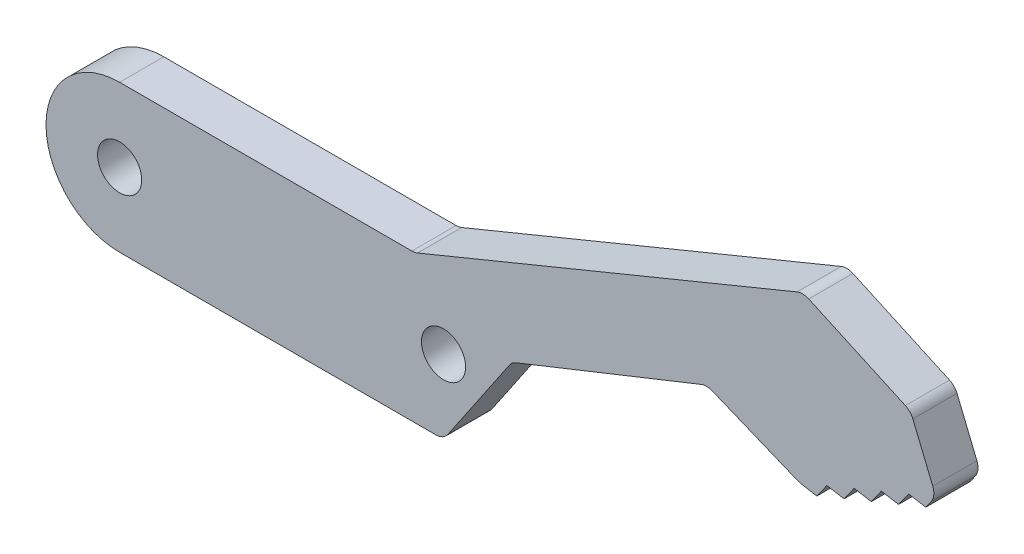
ISO-10303-21;
HEADER;
FILE_DESCRIPTION(('STEP AP214'),'2;1');
FILE_NAME('part.step','',(''),(''),'','','');
FILE_SCHEMA(('AUTOMOTIVE_DESIGN { 1 0 10303 214 1 1 1 1 }'));
ENDSEC;
DATA;
#1=APPLICATION_CONTEXT('core data for automotive mechanical design processes');
#2=APPLICATION_PROTOCOL_DEFINITION('international standard','automotive_design',2000,#1);
#3=PRODUCT_CONTEXT('',#1,'mechanical');
#4=PRODUCT('Part','Part','',(#3));
#5=PRODUCT_RELATED_PRODUCT_CATEGORY('part','',(#4));
#6=PRODUCT_DEFINITION_FORMATION('','',#4);
#7=PRODUCT_DEFINITION_CONTEXT('part definition',#1,'design');
#8=PRODUCT_DEFINITION('design','',#6,#7);
#9=PRODUCT_DEFINITION_SHAPE('','',#8);
#10=(LENGTH_UNIT() NAMED_UNIT(*) SI_UNIT(.MILLI.,.METRE.));
#11=(NAMED_UNIT(*) PLANE_ANGLE_UNIT() SI_UNIT($,.RADIAN.));
#12=(NAMED_UNIT(*) SI_UNIT($,.STERADIAN.) SOLID_ANGLE_UNIT());
#13=UNCERTAINTY_MEASURE_WITH_UNIT(LENGTH_MEASURE(1.E-05),#10,'distance_accuracy_value','');
#14=(GEOMETRIC_REPRESENTATION_CONTEXT(3) GLOBAL_UNCERTAINTY_ASSIGNED_CONTEXT((#13)) GLOBAL_UNIT_ASSIGNED_CONTEXT((#10,
#11,#12)) REPRESENTATION_CONTEXT('',''));
#15=CARTESIAN_POINT('',(0.,0.,0.));
#16=DIRECTION('',(0.,0.,1.));
#17=DIRECTION('',(1.,0.,0.));
#18=AXIS2_PLACEMENT_3D('',#15,#16,#17);
#19=CARTESIAN_POINT('',(17.3962094769043,-11.7918515015879,3.));
#20=DIRECTION('',(0.82775687017251,-0.561086948593719,0.));
#21=DIRECTION('',(0.561086948593719,0.82775687017251,0.));
#22=AXIS2_PLACEMENT_3D('',#19,#20,#21);
#23=PLANE('',#22);
#24=DIRECTION('',(-0.561086948593719,-0.82775687017251,0.));
#25=VECTOR('',#24,1.);
#26=CARTESIAN_POINT('',(17.3962094769043,-11.7918515015879,0.));
#27=LINE('',#26,#25);
#28=CARTESIAN_POINT('',(26.4721926347983,1.59770858592846,0.));
#29=VERTEX_POINT('',#28);
#30=CARTESIAN_POINT('',(22.2975129456313,-4.56108694859372,0.));
#31=VERTEX_POINT('',#30);
#32=EDGE_CURVE('E351',#29,#31,#27,.T.);
#33=ORIENTED_EDGE('',*,*,#32,.F.);
#34=DIRECTION('',(0.,0.,-1.));
#35=VECTOR('',#34,1.);
#36=CARTESIAN_POINT('',(26.4721926347983,1.59770858592845,3.));
#37=LINE('',#36,#35);
#38=CARTESIAN_POINT('',(26.4721926347983,1.59770858592846,3.));
#39=VERTEX_POINT('',#38);
#40=EDGE_CURVE('E254',#29,#39,#37,.F.);
#41=ORIENTED_EDGE('',*,*,#40,.T.);
#42=DIRECTION('',(-0.561086948593719,-0.82775687017251,0.));
#43=VECTOR('',#42,1.);
#44=CARTESIAN_POINT('',(17.3962094769043,-11.7918515015879,3.));
#45=LINE('',#44,#43);
#46=CARTESIAN_POINT('',(22.2975129456313,-4.56108694859372,3.));
#47=VERTEX_POINT('',#46);
#48=EDGE_CURVE('E768',#39,#47,#45,.T.);
#49=ORIENTED_EDGE('',*,*,#48,.T.);
#50=DIRECTION('',(0.,0.,-1.));
#51=VECTOR('',#50,1.);
#52=CARTESIAN_POINT('',(22.2975129456313,-4.56108694859372,0.));
#53=LINE('',#52,#51);
#54=EDGE_CURVE('E251',#47,#31,#53,.T.);
#55=ORIENTED_EDGE('',*,*,#54,.T.);
#56=EDGE_LOOP('',(#33,#41,#49,#55));
#57=FACE_BOUND('',#56,.T.);
#58=ADVANCED_FACE('F34',(#57),#23,.T.);
#59=CARTESIAN_POINT('',(3.01771045687276,-7.56855690668185,3.));
#60=DIRECTION('',(0.370362872235569,-0.928887152925166,0.));
#61=DIRECTION('',(0.928887152925166,0.370362872235569,0.));
#62=AXIS2_PLACEMENT_3D('',#59,#60,#61);
#63=PLANE('',#62);
#64=DIRECTION('',(-0.928887152925166,-0.370362872235569,0.));
#65=VECTOR('',#64,1.);
#66=CARTESIAN_POINT('',(3.01771045687276,-7.56855690668185,3.));
#67=LINE('',#66,#65);
#68=CARTESIAN_POINT('',(39.4964940516571,6.97614534835353,3.));
#69=VERTEX_POINT('',#68);
#70=CARTESIAN_POINT('',(26.9295866327353,1.9655087902599,3.));
#71=VERTEX_POINT('',#70);
#72=EDGE_CURVE('E775',#69,#71,#67,.T.);
#73=ORIENTED_EDGE('',*,*,#72,.T.);
#74=DIRECTION('',(0.,0.,-1.));
#75=VECTOR('',#74,1.);
#76=CARTESIAN_POINT('',(26.9295866327353,1.9655087902599,0.));
#77=LINE('',#76,#75);
#78=CARTESIAN_POINT('',(26.9295866327353,1.9655087902599,0.));
#79=VERTEX_POINT('',#78);
#80=EDGE_CURVE('E243',#71,#79,#77,.T.);
#81=ORIENTED_EDGE('',*,*,#80,.T.);
#82=DIRECTION('',(-0.928887152925166,-0.370362872235569,0.));
#83=VECTOR('',#82,1.);
#84=CARTESIAN_POINT('',(3.01771045687276,-7.56855690668185,0.));
#85=LINE('',#84,#83);
#86=CARTESIAN_POINT('',(39.4964940516571,6.97614534835353,0.));
#87=VERTEX_POINT('',#86);
#88=EDGE_CURVE('E353',#87,#79,#85,.T.);
#89=ORIENTED_EDGE('',*,*,#88,.F.);
#90=DIRECTION('',(0.,0.,-1.));
#91=VECTOR('',#90,1.);
#92=CARTESIAN_POINT('',(39.4964940516571,6.97614534835353,3.));
#93=LINE('',#92,#91);
#94=EDGE_CURVE('E241',#87,#69,#93,.F.);
#95=ORIENTED_EDGE('',*,*,#94,.T.);
#96=EDGE_LOOP('',(#73,#81,#89,#95));
#97=FACE_BOUND('',#96,.T.);
#98=ADVANCED_FACE('F496',(#97),#63,.T.);
#99=CARTESIAN_POINT('',(8.22079154562797,20.0822867610106,3.));
#100=DIRECTION('',(-0.378842481424512,-0.925461168428,0.));
#101=DIRECTION('',(0.925461168428,-0.378842481424512,0.));
#102=AXIS2_PLACEMENT_3D('',#99,#100,#101);
#103=PLANE('',#102);
#104=DIRECTION('',(-0.925461168428,0.378842481424512,0.));
#105=VECTOR('',#104,1.);
#106=CARTESIAN_POINT('',(8.22079154562797,20.0822867610106,3.));
#107=LINE('',#106,#105);
#108=CARTESIAN_POINT('',(46.0879419933528,4.58116609869354,3.));
#109=VERTEX_POINT('',#108);
#110=CARTESIAN_POINT('',(40.2456994053172,6.97271936385637,3.));
#111=VERTEX_POINT('',#110);
#112=EDGE_CURVE('E226',#109,#111,#107,.T.);
#113=ORIENTED_EDGE('',*,*,#112,.T.);
#114=DIRECTION('',(0.,0.,-1.));
#115=VECTOR('',#114,1.);
#116=CARTESIAN_POINT('',(40.2456994053171,6.97271936385637,0.));
#117=LINE('',#116,#115);
#118=CARTESIAN_POINT('',(40.2456994053172,6.97271936385637,0.));
#119=VERTEX_POINT('',#118);
#120=EDGE_CURVE('E278',#111,#119,#117,.T.);
#121=ORIENTED_EDGE('',*,*,#120,.T.);
#122=DIRECTION('',(-0.925461168428,0.378842481424512,0.));
#123=VECTOR('',#122,1.);
#124=CARTESIAN_POINT('',(8.22079154562797,20.0822867610106,0.));
#125=LINE('',#124,#123);
#126=CARTESIAN_POINT('',(46.0879419933528,4.58116609869354,0.));
#127=VERTEX_POINT('',#126);
#128=EDGE_CURVE('E356',#127,#119,#125,.T.);
#129=ORIENTED_EDGE('',*,*,#128,.F.);
#130=DIRECTION('',(0.,0.,-1.));
#131=VECTOR('',#130,1.);
#132=CARTESIAN_POINT('',(46.0879419933528,4.58116609869354,3.));
#133=LINE('',#132,#131);
#134=EDGE_CURVE('E276',#127,#109,#133,.F.);
#135=ORIENTED_EDGE('',*,*,#134,.T.);
#136=EDGE_LOOP('',(#113,#121,#129,#135));
#137=FACE_BOUND('',#136,.T.);
#138=ADVANCED_FACE('F502',(#137),#103,.T.);
#139=CARTESIAN_POINT('',(2.12068725055261,12.2001062019428,3.));
#140=DIRECTION('',(0.171257275030367,0.985226342395073,0.));
#141=DIRECTION('',(-0.985226342395073,0.171257275030367,0.));
#142=AXIS2_PLACEMENT_3D('',#139,#140,#141);
#143=PLANE('',#142);
#144=DIRECTION('',(0.985226342395073,-0.171257275030367,0.));
#145=VECTOR('',#144,1.);
#146=CARTESIAN_POINT('',(2.12068725055261,12.2001062019428,3.));
#147=LINE('',#146,#145);
#148=CARTESIAN_POINT('',(46.2955271997469,4.52140092472648,3.));
#149=VERTEX_POINT('',#148);
#150=CARTESIAN_POINT('',(47.3529322035688,4.33759717145107,3.));
#151=VERTEX_POINT('',#150);
#152=EDGE_CURVE('E212',#149,#151,#147,.T.);
#153=ORIENTED_EDGE('',*,*,#152,.F.);
#154=DIRECTION('',(0.,0.,-1.));
#155=VECTOR('',#154,1.);
#156=CARTESIAN_POINT('',(46.2955271997469,4.52140092472648,0.));
#157=LINE('',#156,#155);
#158=CARTESIAN_POINT('',(46.2955271997469,4.52140092472648,0.));
#159=VERTEX_POINT('',#158);
#160=EDGE_CURVE('E281',#149,#159,#157,.T.);
#161=ORIENTED_EDGE('',*,*,#160,.T.);
#162=DIRECTION('',(0.985226342395073,-0.171257275030367,0.));
#163=VECTOR('',#162,1.);
#164=CARTESIAN_POINT('',(2.12068725055261,12.2001062019428,0.));
#165=LINE('',#164,#163);
#166=CARTESIAN_POINT('',(47.3529322035688,4.33759717145107,0.));
#167=VERTEX_POINT('',#166);
#168=EDGE_CURVE('E239',#159,#167,#165,.T.);
#169=ORIENTED_EDGE('',*,*,#168,.T.);
#170=DIRECTION('',(0.,0.,-1.));
#171=VECTOR('',#170,1.);
#172=CARTESIAN_POINT('',(47.3529322035688,4.33759717145107,3.));
#173=LINE('',#172,#171);
#174=EDGE_CURVE('E232',#151,#167,#173,.T.);
#175=ORIENTED_EDGE('',*,*,#174,.F.);
#176=EDGE_LOOP('',(#153,#161,#169,#175));
#177=FACE_BOUND('',#176,.T.);
#178=ADVANCED_FACE('F237',(#177),#143,.F.);
#179=CARTESIAN_POINT('',(29.3832302084347,-20.911746854221,3.));
#180=DIRECTION('',(-0.814732571298571,0.579836905746106,0.));
#181=DIRECTION('',(-0.579836905746107,-0.814732571298571,0.));
#182=AXIS2_PLACEMENT_3D('',#179,#180,#181);
#183=PLANE('',#182);
#184=DIRECTION('',(0.579836905746107,0.814732571298571,0.));
#185=VECTOR('',#184,1.);
#186=CARTESIAN_POINT('',(29.3832302084347,-20.911746854221,0.));
#187=LINE('',#186,#185);
#188=CARTESIAN_POINT('',(48.0382444817135,5.30053386792921,0.));
#189=VERTEX_POINT('',#188);
#190=EDGE_CURVE('E360',#167,#189,#187,.T.);
#191=ORIENTED_EDGE('',*,*,#190,.T.);
#192=DIRECTION('',(0.,0.,-1.));
#193=VECTOR('',#192,1.);
#194=CARTESIAN_POINT('',(48.0382444817135,5.30053386792921,3.));
#195=LINE('',#194,#193);
#196=CARTESIAN_POINT('',(48.0382444817135,5.30053386792921,3.));
#197=VERTEX_POINT('',#196);
#198=EDGE_CURVE('E234',#197,#189,#195,.T.);
#199=ORIENTED_EDGE('',*,*,#198,.F.);
#200=DIRECTION('',(0.579836905746107,0.814732571298571,0.));
#201=VECTOR('',#200,1.);
#202=CARTESIAN_POINT('',(29.3832302084347,-20.911746854221,3.));
#203=LINE('',#202,#201);
#204=EDGE_CURVE('E217',#151,#197,#203,.T.);
#205=ORIENTED_EDGE('',*,*,#204,.F.);
#206=ORIENTED_EDGE('',*,*,#174,.T.);
#207=EDGE_LOOP('',(#191,#199,#205,#206));
#208=FACE_BOUND('',#207,.T.);
#209=ADVANCED_FACE('F231',(#208),#183,.F.);
#210=CARTESIAN_POINT('',(2.30326040358772,13.2504316830205,3.));
#211=DIRECTION('',(0.171257275030366,0.985226342395073,0.));
#212=DIRECTION('',(-0.985226342395073,0.171257275030366,0.));
#213=AXIS2_PLACEMENT_3D('',#210,#211,#212);
#214=PLANE('',#213);
#215=DIRECTION('',(0.985226342395073,-0.171257275030366,0.));
#216=VECTOR('',#215,1.);
#217=CARTESIAN_POINT('',(2.30326040358772,13.2504316830205,0.));
#218=LINE('',#217,#216);
#219=CARTESIAN_POINT('',(49.2026886599019,5.09812399691749,0.));
#220=VERTEX_POINT('',#219);
#221=EDGE_CURVE('E362',#189,#220,#218,.T.);
#222=ORIENTED_EDGE('',*,*,#221,.T.);
#223=DIRECTION('',(0.,0.,-1.));
#224=VECTOR('',#223,1.);
#225=CARTESIAN_POINT('',(49.2026886599019,5.09812399691749,3.));
#226=LINE('',#225,#224);
#227=CARTESIAN_POINT('',(49.2026886599019,5.09812399691749,3.));
#228=VERTEX_POINT('',#227);
#229=EDGE_CURVE('E245',#228,#220,#226,.T.);
#230=ORIENTED_EDGE('',*,*,#229,.F.);
#231=DIRECTION('',(0.985226342395073,-0.171257275030366,0.));
#232=VECTOR('',#231,1.);
#233=CARTESIAN_POINT('',(2.30326040358772,13.2504316830205,3.));
#234=LINE('',#233,#232);
#235=EDGE_CURVE('E235',#197,#228,#234,.T.);
#236=ORIENTED_EDGE('',*,*,#235,.F.);
#237=ORIENTED_EDGE('',*,*,#198,.T.);
#238=EDGE_LOOP('',(#222,#230,#236,#237));
#239=FACE_BOUND('',#238,.T.);
#240=ADVANCED_FACE('F427',(#239),#214,.F.);
#241=CARTESIAN_POINT('',(30.2517964891723,-21.5298966648462,3.));
#242=DIRECTION('',(-0.81473257129857,0.579836905746108,0.));
#243=DIRECTION('',(-0.579836905746108,-0.81473257129857,0.));
#244=AXIS2_PLACEMENT_3D('',#241,#242,#243);
#245=PLANE('',#244);
#246=DIRECTION('',(0.579836905746108,0.81473257129857,0.));
#247=VECTOR('',#246,1.);
#248=CARTESIAN_POINT('',(30.2517964891723,-21.5298966648462,0.));
#249=LINE('',#248,#247);
#250=CARTESIAN_POINT('',(49.8880009380466,6.06106069339563,0.));
#251=VERTEX_POINT('',#250);
#252=EDGE_CURVE('E365',#220,#251,#249,.T.);
#253=ORIENTED_EDGE('',*,*,#252,.T.);
#254=DIRECTION('',(0.,0.,-1.));
#255=VECTOR('',#254,1.);
#256=CARTESIAN_POINT('',(49.8880009380466,6.06106069339563,3.));
#257=LINE('',#256,#255);
#258=CARTESIAN_POINT('',(49.8880009380466,6.06106069339563,3.));
#259=VERTEX_POINT('',#258);
#260=EDGE_CURVE('E417',#259,#251,#257,.T.);
#261=ORIENTED_EDGE('',*,*,#260,.F.);
#262=DIRECTION('',(0.579836905746108,0.81473257129857,0.));
#263=VECTOR('',#262,1.);
#264=CARTESIAN_POINT('',(30.2517964891723,-21.5298966648462,3.));
#265=LINE('',#264,#263);
#266=EDGE_CURVE('E425',#228,#259,#265,.T.);
#267=ORIENTED_EDGE('',*,*,#266,.F.);
#268=ORIENTED_EDGE('',*,*,#229,.T.);
#269=EDGE_LOOP('',(#253,#261,#267,#268));
#270=FACE_BOUND('',#269,.T.);
#271=ADVANCED_FACE('F422',(#270),#245,.F.);
#272=CARTESIAN_POINT('',(2.48583355662284,14.3007571640983,3.));
#273=DIRECTION('',(0.171257275030366,0.985226342395073,0.));
#274=DIRECTION('',(-0.985226342395073,0.171257275030366,0.));
#275=AXIS2_PLACEMENT_3D('',#272,#273,#274);
#276=PLANE('',#275);
#277=DIRECTION('',(0.985226342395073,-0.171257275030366,0.));
#278=VECTOR('',#277,1.);
#279=CARTESIAN_POINT('',(2.48583355662284,14.3007571640983,0.));
#280=LINE('',#279,#278);
#281=CARTESIAN_POINT('',(51.052445116235,5.85865082238391,0.));
#282=VERTEX_POINT('',#281);
#283=EDGE_CURVE('E368',#251,#282,#280,.T.);
#284=ORIENTED_EDGE('',*,*,#283,.T.);
#285=DIRECTION('',(0.,0.,-1.));
#286=VECTOR('',#285,1.);
#287=CARTESIAN_POINT('',(51.052445116235,5.85865082238391,3.));
#288=LINE('',#287,#286);
#289=CARTESIAN_POINT('',(51.052445116235,5.85865082238391,3.));
#290=VERTEX_POINT('',#289);
#291=EDGE_CURVE('E414',#290,#282,#288,.T.);
#292=ORIENTED_EDGE('',*,*,#291,.F.);
#293=DIRECTION('',(0.985226342395073,-0.171257275030366,0.));
#294=VECTOR('',#293,1.);
#295=CARTESIAN_POINT('',(2.48583355662284,14.3007571640983,3.));
#296=LINE('',#295,#294);
#297=EDGE_CURVE('E432',#259,#290,#296,.T.);
#298=ORIENTED_EDGE('',*,*,#297,.F.);
#299=ORIENTED_EDGE('',*,*,#260,.T.);
#300=EDGE_LOOP('',(#284,#292,#298,#299));
#301=FACE_BOUND('',#300,.T.);
#302=ADVANCED_FACE('F430',(#301),#276,.F.);
#303=CARTESIAN_POINT('',(31.1203627699101,-22.1480464754713,3.));
#304=DIRECTION('',(-0.814732571298571,0.579836905746105,0.));
#305=DIRECTION('',(-0.579836905746105,-0.814732571298572,0.));
#306=AXIS2_PLACEMENT_3D('',#303,#304,#305);
#307=PLANE('',#306);
#308=DIRECTION('',(0.579836905746105,0.814732571298572,0.));
#309=VECTOR('',#308,1.);
#310=CARTESIAN_POINT('',(31.1203627699101,-22.1480464754713,0.));
#311=LINE('',#310,#309);
#312=CARTESIAN_POINT('',(51.7377573943797,6.82158751886204,0.));
#313=VERTEX_POINT('',#312);
#314=EDGE_CURVE('E371',#282,#313,#311,.T.);
#315=ORIENTED_EDGE('',*,*,#314,.T.);
#316=DIRECTION('',(0.,0.,-1.));
#317=VECTOR('',#316,1.);
#318=CARTESIAN_POINT('',(51.7377573943797,6.82158751886204,3.));
#319=LINE('',#318,#317);
#320=CARTESIAN_POINT('',(51.7377573943797,6.82158751886204,3.));
#321=VERTEX_POINT('',#320);
#322=EDGE_CURVE('E411',#321,#313,#319,.T.);
#323=ORIENTED_EDGE('',*,*,#322,.F.);
#324=DIRECTION('',(0.579836905746105,0.814732571298572,0.));
#325=VECTOR('',#324,1.);
#326=CARTESIAN_POINT('',(31.1203627699101,-22.1480464754713,3.));
#327=LINE('',#326,#325);
#328=EDGE_CURVE('E434',#290,#321,#327,.T.);
#329=ORIENTED_EDGE('',*,*,#328,.F.);
#330=ORIENTED_EDGE('',*,*,#291,.T.);
#331=EDGE_LOOP('',(#315,#323,#329,#330));
#332=FACE_BOUND('',#331,.T.);
#333=ADVANCED_FACE('F486',(#332),#307,.F.);
#334=CARTESIAN_POINT('',(2.66840670965796,15.351082645176,3.));
#335=DIRECTION('',(0.171257275030366,0.985226342395073,0.));
#336=DIRECTION('',(-0.985226342395073,0.171257275030366,0.));
#337=AXIS2_PLACEMENT_3D('',#334,#335,#336);
#338=PLANE('',#337);
#339=DIRECTION('',(0.985226342395073,-0.171257275030366,0.));
#340=VECTOR('',#339,1.);
#341=CARTESIAN_POINT('',(2.66840670965796,15.351082645176,0.));
#342=LINE('',#341,#340);
#343=CARTESIAN_POINT('',(52.9022015725681,6.61917764785032,0.));
#344=VERTEX_POINT('',#343);
#345=EDGE_CURVE('E374',#313,#344,#342,.T.);
#346=ORIENTED_EDGE('',*,*,#345,.T.);
#347=DIRECTION('',(0.,0.,-1.));
#348=VECTOR('',#347,1.);
#349=CARTESIAN_POINT('',(52.9022015725681,6.61917764785032,3.));
#350=LINE('',#349,#348);
#351=CARTESIAN_POINT('',(52.9022015725681,6.61917764785032,3.));
#352=VERTEX_POINT('',#351);
#353=EDGE_CURVE('E408',#352,#344,#350,.T.);
#354=ORIENTED_EDGE('',*,*,#353,.F.);
#355=DIRECTION('',(0.985226342395073,-0.171257275030366,0.));
#356=VECTOR('',#355,1.);
#357=CARTESIAN_POINT('',(2.66840670965796,15.351082645176,3.));
#358=LINE('',#357,#356);
#359=EDGE_CURVE('E440',#321,#352,#358,.T.);
#360=ORIENTED_EDGE('',*,*,#359,.F.);
#361=ORIENTED_EDGE('',*,*,#322,.T.);
#362=EDGE_LOOP('',(#346,#354,#360,#361));
#363=FACE_BOUND('',#362,.T.);
#364=ADVANCED_FACE('F483',(#363),#338,.F.);
#365=CARTESIAN_POINT('',(31.988929050648,-22.7661962860964,3.));
#366=DIRECTION('',(-0.814732571298574,0.579836905746103,0.));
#367=DIRECTION('',(-0.579836905746103,-0.814732571298574,0.));
#368=AXIS2_PLACEMENT_3D('',#365,#366,#367);
#369=PLANE('',#368);
#370=DIRECTION('',(0.579836905746103,0.814732571298574,0.));
#371=VECTOR('',#370,1.);
#372=CARTESIAN_POINT('',(31.988929050648,-22.7661962860964,0.));
#373=LINE('',#372,#371);
#374=CARTESIAN_POINT('',(53.5875138507128,7.58211434432846,0.));
#375=VERTEX_POINT('',#374);
#376=EDGE_CURVE('E377',#344,#375,#373,.T.);
#377=ORIENTED_EDGE('',*,*,#376,.T.);
#378=DIRECTION('',(0.,0.,-1.));
#379=VECTOR('',#378,1.);
#380=CARTESIAN_POINT('',(53.5875138507128,7.58211434432846,3.));
#381=LINE('',#380,#379);
#382=CARTESIAN_POINT('',(53.5875138507128,7.58211434432846,3.));
#383=VERTEX_POINT('',#382);
#384=EDGE_CURVE('E405',#383,#375,#381,.T.);
#385=ORIENTED_EDGE('',*,*,#384,.F.);
#386=DIRECTION('',(0.579836905746103,0.814732571298574,0.));
#387=VECTOR('',#386,1.);
#388=CARTESIAN_POINT('',(31.988929050648,-22.7661962860964,3.));
#389=LINE('',#388,#387);
#390=EDGE_CURVE('E443',#352,#383,#389,.T.);
#391=ORIENTED_EDGE('',*,*,#390,.F.);
#392=ORIENTED_EDGE('',*,*,#353,.T.);
#393=EDGE_LOOP('',(#377,#385,#391,#392));
#394=FACE_BOUND('',#393,.T.);
#395=ADVANCED_FACE('F481',(#394),#369,.F.);
#396=CARTESIAN_POINT('',(2.85097986269345,16.4014081262544,3.));
#397=DIRECTION('',(0.171257275030381,0.98522634239507,0.));
#398=DIRECTION('',(-0.985226342395071,0.171257275030381,0.));
#399=AXIS2_PLACEMENT_3D('',#396,#397,#398);
#400=PLANE('',#399);
#401=DIRECTION('',(0.98522634239507,-0.171257275030381,0.));
#402=VECTOR('',#401,1.);
#403=CARTESIAN_POINT('',(2.85097986269345,16.4014081262544,0.));
#404=LINE('',#403,#402);
#405=CARTESIAN_POINT('',(54.7519580289012,7.37970447331672,0.));
#406=VERTEX_POINT('',#405);
#407=EDGE_CURVE('E380',#375,#406,#404,.T.);
#408=ORIENTED_EDGE('',*,*,#407,.T.);
#409=DIRECTION('',(0.,0.,-1.));
#410=VECTOR('',#409,1.);
#411=CARTESIAN_POINT('',(54.7519580289012,7.37970447331672,3.));
#412=LINE('',#411,#410);
#413=CARTESIAN_POINT('',(54.7519580289012,7.37970447331672,3.));
#414=VERTEX_POINT('',#413);
#415=EDGE_CURVE('E402',#414,#406,#412,.T.);
#416=ORIENTED_EDGE('',*,*,#415,.F.);
#417=DIRECTION('',(0.98522634239507,-0.171257275030381,0.));
#418=VECTOR('',#417,1.);
#419=CARTESIAN_POINT('',(2.85097986269345,16.4014081262544,3.));
#420=LINE('',#419,#418);
#421=EDGE_CURVE('E446',#383,#414,#420,.T.);
#422=ORIENTED_EDGE('',*,*,#421,.F.);
#423=ORIENTED_EDGE('',*,*,#384,.T.);
#424=EDGE_LOOP('',(#408,#416,#422,#423));
#425=FACE_BOUND('',#424,.T.);
#426=ADVANCED_FACE('F477',(#425),#400,.F.);
#427=CARTESIAN_POINT('',(32.8574953313856,-23.3843460967215,3.));
#428=DIRECTION('',(-0.814732571298573,0.579836905746103,0.));
#429=DIRECTION('',(-0.579836905746103,-0.814732571298573,0.));
#430=AXIS2_PLACEMENT_3D('',#427,#428,#429);
#431=PLANE('',#430);
#432=DIRECTION('',(0.579836905746103,0.814732571298573,0.));
#433=VECTOR('',#432,1.);
#434=CARTESIAN_POINT('',(32.8574953313856,-23.3843460967215,0.));
#435=LINE('',#434,#433);
#436=CARTESIAN_POINT('',(55.1172552795213,7.89298599323486,0.));
#437=VERTEX_POINT('',#436);
#438=EDGE_CURVE('E383',#406,#437,#435,.T.);
#439=ORIENTED_EDGE('',*,*,#438,.T.);
#440=DIRECTION('',(0.,0.,-1.));
#441=VECTOR('',#440,1.);
#442=CARTESIAN_POINT('',(55.1172552795213,7.89298599323485,3.));
#443=LINE('',#442,#441);
#444=CARTESIAN_POINT('',(55.1172552795213,7.89298599323486,3.));
#445=VERTEX_POINT('',#444);
#446=EDGE_CURVE('E288',#437,#445,#443,.F.);
#447=ORIENTED_EDGE('',*,*,#446,.T.);
#448=DIRECTION('',(0.579836905746103,0.814732571298573,0.));
#449=VECTOR('',#448,1.);
#450=CARTESIAN_POINT('',(32.8574953313856,-23.3843460967215,3.));
#451=LINE('',#450,#449);
#452=EDGE_CURVE('E449',#414,#445,#451,.T.);
#453=ORIENTED_EDGE('',*,*,#452,.F.);
#454=ORIENTED_EDGE('',*,*,#415,.T.);
#455=EDGE_LOOP('',(#439,#447,#453,#454));
#456=FACE_BOUND('',#455,.T.);
#457=ADVANCED_FACE('F474',(#456),#431,.F.);
#458=CARTESIAN_POINT('',(50.3551112402656,20.703489243922,3.));
#459=DIRECTION('',(0.924878228166548,0.380263412733208,0.));
#460=DIRECTION('',(-0.380263412733208,0.924878228166548,0.));
#461=AXIS2_PLACEMENT_3D('',#458,#459,#460);
#462=PLANE('',#461);
#463=DIRECTION('',(0.380263412733209,-0.924878228166548,0.));
#464=VECTOR('',#463,1.);
#465=CARTESIAN_POINT('',(50.3551112402656,20.703489243922,3.));
#466=LINE('',#465,#464);
#467=CARTESIAN_POINT('',(53.8764912996726,12.138774256918,3.));
#468=VERTEX_POINT('',#467);
#469=CARTESIAN_POINT('',(55.2274009363892,8.85308631171416,3.));
#470=VERTEX_POINT('',#469);
#471=EDGE_CURVE('E452',#468,#470,#466,.T.);
#472=ORIENTED_EDGE('',*,*,#471,.T.);
#473=DIRECTION('',(0.,0.,-1.));
#474=VECTOR('',#473,1.);
#475=CARTESIAN_POINT('',(55.2274009363892,8.85308631171416,0.));
#476=LINE('',#475,#474);
#477=CARTESIAN_POINT('',(55.2274009363892,8.85308631171416,0.));
#478=VERTEX_POINT('',#477);
#479=EDGE_CURVE('E285',#470,#478,#476,.T.);
#480=ORIENTED_EDGE('',*,*,#479,.T.);
#481=DIRECTION('',(0.380263412733209,-0.924878228166548,0.));
#482=VECTOR('',#481,1.);
#483=CARTESIAN_POINT('',(50.3551112402656,20.703489243922,0.));
#484=LINE('',#483,#482);
#485=CARTESIAN_POINT('',(53.8764912996726,12.138774256918,0.));
#486=VERTEX_POINT('',#485);
#487=EDGE_CURVE('E386',#486,#478,#484,.T.);
#488=ORIENTED_EDGE('',*,*,#487,.F.);
#489=DIRECTION('',(0.,0.,-1.));
#490=VECTOR('',#489,1.);
#491=CARTESIAN_POINT('',(53.8764912996726,12.138774256918,3.));
#492=LINE('',#491,#490);
#493=EDGE_CURVE('E283',#486,#468,#492,.F.);
#494=ORIENTED_EDGE('',*,*,#493,.T.);
#495=EDGE_LOOP('',(#472,#480,#488,#494));
#496=FACE_BOUND('',#495,.T.);
#497=ADVANCED_FACE('F466',(#496),#462,.T.);
#498=CARTESIAN_POINT('',(13.9488099268583,30.6231164748254,3.));
#499=DIRECTION('',(0.414522259932087,0.910039172794663,0.));
#500=DIRECTION('',(-0.910039172794663,0.414522259932087,0.));
#501=AXIS2_PLACEMENT_3D('',#498,#499,#500);
#502=PLANE('',#501);
#503=DIRECTION('',(0.910039172794663,-0.414522259932087,0.));
#504=VECTOR('',#503,1.);
#505=CARTESIAN_POINT('',(13.9488099268583,30.6231164748254,3.));
#506=LINE('',#505,#504);
#507=CARTESIAN_POINT('',(46.8032086062433,15.6579589338968,3.));
#508=VERTEX_POINT('',#507);
#509=CARTESIAN_POINT('',(53.3661353314382,12.6685500169795,3.));
#510=VERTEX_POINT('',#509);
#511=EDGE_CURVE('E339',#508,#510,#506,.T.);
#512=ORIENTED_EDGE('',*,*,#511,.T.);
#513=DIRECTION('',(0.,0.,-1.));
#514=VECTOR('',#513,1.);
#515=CARTESIAN_POINT('',(53.3661353314382,12.6685500169795,3.));
#516=LINE('',#515,#514);
#517=CARTESIAN_POINT('',(53.3661353314382,12.6685500169795,0.));
#518=VERTEX_POINT('',#517);
#519=EDGE_CURVE('E292',#510,#518,#516,.T.);
#520=ORIENTED_EDGE('',*,*,#519,.T.);
#521=DIRECTION('',(0.910039172794663,-0.414522259932087,0.));
#522=VECTOR('',#521,1.);
#523=CARTESIAN_POINT('',(13.9488099268583,30.6231164748254,0.));
#524=LINE('',#523,#522);
#525=CARTESIAN_POINT('',(46.8032086062433,15.6579589338968,0.));
#526=VERTEX_POINT('',#525);
#527=EDGE_CURVE('E326',#526,#518,#524,.T.);
#528=ORIENTED_EDGE('',*,*,#527,.F.);
#529=DIRECTION('',(0.,0.,-1.));
#530=VECTOR('',#529,1.);
#531=CARTESIAN_POINT('',(46.8032086062433,15.6579589338968,3.));
#532=LINE('',#531,#530);
#533=EDGE_CURVE('E290',#526,#508,#532,.F.);
#534=ORIENTED_EDGE('',*,*,#533,.T.);
#535=EDGE_LOOP('',(#512,#520,#528,#534));
#536=FACE_BOUND('',#535,.T.);
#537=ADVANCED_FACE('F457',(#536),#502,.T.);
#538=CARTESIAN_POINT('',(1.14074851739701,-2.77453321099285,3.));
#539=DIRECTION('',(-0.380263412733207,0.924878228166549,0.));
#540=DIRECTION('',(-0.924878228166549,-0.380263412733207,0.));
#541=AXIS2_PLACEMENT_3D('',#538,#539,#540);
#542=PLANE('',#541);
#543=DIRECTION('',(0.924878228166549,0.380263412733207,0.));
#544=VECTOR('',#543,1.);
#545=CARTESIAN_POINT('',(1.14074851739701,-2.77453321099285,3.));
#546=LINE('',#545,#544);
#547=CARTESIAN_POINT('',(20.2327114807882,5.07512177183346,3.));
#548=VERTEX_POINT('',#547);
#549=CARTESIAN_POINT('',(46.0084229335781,15.6727979892687,3.));
#550=VERTEX_POINT('',#549);
#551=EDGE_CURVE('E335',#548,#550,#546,.T.);
#552=ORIENTED_EDGE('',*,*,#551,.T.);
#553=DIRECTION('',(0.,0.,-1.));
#554=VECTOR('',#553,1.);
#555=CARTESIAN_POINT('',(46.0084229335781,15.6727979892687,3.));
#556=LINE('',#555,#554);
#557=CARTESIAN_POINT('',(46.0084229335781,15.6727979892687,0.));
#558=VERTEX_POINT('',#557);
#559=EDGE_CURVE('E297',#550,#558,#556,.T.);
#560=ORIENTED_EDGE('',*,*,#559,.T.);
#561=DIRECTION('',(0.924878228166549,0.380263412733207,0.));
#562=VECTOR('',#561,1.);
#563=CARTESIAN_POINT('',(1.14074851739701,-2.77453321099285,0.));
#564=LINE('',#563,#562);
#565=CARTESIAN_POINT('',(20.2327114807882,5.07512177183346,0.));
#566=VERTEX_POINT('',#565);
#567=EDGE_CURVE('E316',#566,#558,#564,.T.);
#568=ORIENTED_EDGE('',*,*,#567,.F.);
#569=DIRECTION('',(0.,0.,-1.));
#570=VECTOR('',#569,1.);
#571=CARTESIAN_POINT('',(20.2327114807882,5.07512177183345,3.));
#572=LINE('',#571,#570);
#573=EDGE_CURVE('E295',#566,#548,#572,.F.);
#574=ORIENTED_EDGE('',*,*,#573,.T.);
#575=EDGE_LOOP('',(#552,#560,#568,#574));
#576=FACE_BOUND('',#575,.T.);
#577=ADVANCED_FACE('F324',(#576),#542,.T.);
#578=CARTESIAN_POINT('',(0.,5.,3.));
#579=DIRECTION('',(0.,1.,0.));
#580=DIRECTION('',(0.,0.,1.));
#581=AXIS2_PLACEMENT_3D('',#578,#579,#580);
#582=PLANE('',#581);
#583=DIRECTION('',(1.,0.,0.));
#584=VECTOR('',#583,1.);
#585=CARTESIAN_POINT('',(0.,5.,3.));
#586=LINE('',#585,#584);
#587=CARTESIAN_POINT('',(0.,5.,3.));
#588=VERTEX_POINT('',#587);
#589=CARTESIAN_POINT('',(19.852448068055,5.,3.));
#590=VERTEX_POINT('',#589);
#591=EDGE_CURVE('E330',#588,#590,#586,.T.);
#592=ORIENTED_EDGE('',*,*,#591,.T.);
#593=DIRECTION('',(0.,0.,-1.));
#594=VECTOR('',#593,1.);
#595=CARTESIAN_POINT('',(19.852448068055,5.,0.));
#596=LINE('',#595,#594);
#597=CARTESIAN_POINT('',(19.852448068055,5.,0.));
#598=VERTEX_POINT('',#597);
#599=EDGE_CURVE('E300',#590,#598,#596,.T.);
#600=ORIENTED_EDGE('',*,*,#599,.T.);
#601=DIRECTION('',(1.,0.,0.));
#602=VECTOR('',#601,1.);
#603=CARTESIAN_POINT('',(0.,5.,0.));
#604=LINE('',#603,#602);
#605=CARTESIAN_POINT('',(0.,5.,0.));
#606=VERTEX_POINT('',#605);
#607=EDGE_CURVE('E319',#606,#598,#604,.T.);
#608=ORIENTED_EDGE('',*,*,#607,.F.);
#609=DIRECTION('',(0.,0.,-1.));
#610=VECTOR('',#609,1.);
#611=CARTESIAN_POINT('',(0.,5.,3.));
#612=LINE('',#611,#610);
#613=EDGE_CURVE('E331',#588,#606,#612,.T.);
#614=ORIENTED_EDGE('',*,*,#613,.F.);
#615=EDGE_LOOP('',(#592,#600,#608,#614));
#616=FACE_BOUND('',#615,.T.);
#617=ADVANCED_FACE('F329',(#616),#582,.T.);
#618=CARTESIAN_POINT('',(0.,0.,3.));
#619=DIRECTION('',(0.,0.,-1.));
#620=DIRECTION('',(-1.,0.,0.));
#621=AXIS2_PLACEMENT_3D('',#618,#619,#620);
#622=CYLINDRICAL_SURFACE('',#621,5.);
#623=CARTESIAN_POINT('',(0.,0.,0.));
#624=DIRECTION('',(0.,0.,1.));
#625=DIRECTION('',(1.,0.,0.));
#626=AXIS2_PLACEMENT_3D('',#623,#624,#625);
#627=CIRCLE('',#626,5.);
#628=CARTESIAN_POINT('',(0.,-5.,0.));
#629=VERTEX_POINT('',#628);
#630=EDGE_CURVE('E392',#606,#629,#627,.T.);
#631=ORIENTED_EDGE('',*,*,#630,.T.);
#632=DIRECTION('',(0.,0.,-1.));
#633=VECTOR('',#632,1.);
#634=CARTESIAN_POINT('',(0.,-5.,3.));
#635=LINE('',#634,#633);
#636=CARTESIAN_POINT('',(0.,-5.,3.));
#637=VERTEX_POINT('',#636);
#638=EDGE_CURVE('E344',#637,#629,#635,.T.);
#639=ORIENTED_EDGE('',*,*,#638,.F.);
#640=CARTESIAN_POINT('',(0.,0.,3.));
#641=DIRECTION('',(0.,0.,1.));
#642=DIRECTION('',(1.,0.,0.));
#643=AXIS2_PLACEMENT_3D('',#640,#641,#642);
#644=CIRCLE('',#643,5.);
#645=EDGE_CURVE('E334',#588,#637,#644,.T.);
#646=ORIENTED_EDGE('',*,*,#645,.F.);
#647=ORIENTED_EDGE('',*,*,#613,.T.);
#648=EDGE_LOOP('',(#631,#639,#646,#647));
#649=FACE_BOUND('',#648,.T.);
#650=ADVANCED_FACE('F512',(#649),#622,.T.);
#651=CARTESIAN_POINT('',(0.,0.,3.));
#652=DIRECTION('',(0.,0.,-1.));
#653=DIRECTION('',(-1.,0.,0.));
#654=AXIS2_PLACEMENT_3D('',#651,#652,#653);
#655=CYLINDRICAL_SURFACE('',#654,1.5);
#656=CARTESIAN_POINT('',(0.,0.,3.));
#657=DIRECTION('',(0.,0.,1.));
#658=DIRECTION('',(1.,0.,0.));
#659=AXIS2_PLACEMENT_3D('',#656,#657,#658);
#660=CIRCLE('',#659,1.5);
#661=CARTESIAN_POINT('',(1.5,0.,3.));
#662=VERTEX_POINT('',#661);
#663=EDGE_CURVE('E780',#662,#662,#660,.T.);
#664=ORIENTED_EDGE('',*,*,#663,.T.);
#665=EDGE_LOOP('',(#664));
#666=FACE_BOUND('',#665,.T.);
#667=CARTESIAN_POINT('',(0.,0.,0.));
#668=DIRECTION('',(0.,0.,1.));
#669=DIRECTION('',(1.,0.,0.));
#670=AXIS2_PLACEMENT_3D('',#667,#668,#669);
#671=CIRCLE('',#670,1.5);
#672=CARTESIAN_POINT('',(1.5,0.,0.));
#673=VERTEX_POINT('',#672);
#674=EDGE_CURVE('E348',#673,#673,#671,.T.);
#675=ORIENTED_EDGE('',*,*,#674,.F.);
#676=EDGE_LOOP('',(#675));
#677=FACE_BOUND('',#676,.T.);
#678=ADVANCED_FACE('F508',(#666,#677),#655,.F.);
#679=CARTESIAN_POINT('',(22.,0.,3.));
#680=DIRECTION('',(0.,0.,-1.));
#681=DIRECTION('',(-1.,0.,0.));
#682=AXIS2_PLACEMENT_3D('',#679,#680,#681);
#683=CYLINDRICAL_SURFACE('',#682,1.5);
#684=CARTESIAN_POINT('',(22.,0.,3.));
#685=DIRECTION('',(0.,0.,1.));
#686=DIRECTION('',(1.,0.,0.));
#687=AXIS2_PLACEMENT_3D('',#684,#685,#686);
#688=CIRCLE('',#687,1.5);
#689=CARTESIAN_POINT('',(23.5,0.,3.));
#690=VERTEX_POINT('',#689);
#691=EDGE_CURVE('E398',#690,#690,#688,.T.);
#692=ORIENTED_EDGE('',*,*,#691,.T.);
#693=EDGE_LOOP('',(#692));
#694=FACE_BOUND('',#693,.T.);
#695=CARTESIAN_POINT('',(22.,0.,0.));
#696=DIRECTION('',(0.,0.,1.));
#697=DIRECTION('',(1.,0.,0.));
#698=AXIS2_PLACEMENT_3D('',#695,#696,#697);
#699=CIRCLE('',#698,1.5);
#700=CARTESIAN_POINT('',(23.5,0.,0.));
#701=VERTEX_POINT('',#700);
#702=EDGE_CURVE('E345',#701,#701,#699,.T.);
#703=ORIENTED_EDGE('',*,*,#702,.F.);
#704=EDGE_LOOP('',(#703));
#705=FACE_BOUND('',#704,.T.);
#706=ADVANCED_FACE('F511',(#694,#705),#683,.F.);
#707=CARTESIAN_POINT('',(0.,-5.,3.));
#708=DIRECTION('',(0.,1.,0.));
#709=DIRECTION('',(0.,0.,1.));
#710=AXIS2_PLACEMENT_3D('',#707,#708,#709);
#711=PLANE('',#710);
#712=DIRECTION('',(1.,0.,0.));
#713=VECTOR('',#712,1.);
#714=CARTESIAN_POINT('',(0.,-5.,0.));
#715=LINE('',#714,#713);
#716=CARTESIAN_POINT('',(21.4697560754588,-5.,0.));
#717=VERTEX_POINT('',#716);
#718=EDGE_CURVE('E395',#629,#717,#715,.T.);
#719=ORIENTED_EDGE('',*,*,#718,.T.);
#720=DIRECTION('',(0.,0.,-1.));
#721=VECTOR('',#720,1.);
#722=CARTESIAN_POINT('',(21.4697560754588,-5.,3.));
#723=LINE('',#722,#721);
#724=CARTESIAN_POINT('',(21.4697560754588,-5.,3.));
#725=VERTEX_POINT('',#724);
#726=EDGE_CURVE('E266',#717,#725,#723,.F.);
#727=ORIENTED_EDGE('',*,*,#726,.T.);
#728=DIRECTION('',(1.,0.,0.));
#729=VECTOR('',#728,1.);
#730=CARTESIAN_POINT('',(0.,-5.,3.));
#731=LINE('',#730,#729);
#732=EDGE_CURVE('E337',#637,#725,#731,.T.);
#733=ORIENTED_EDGE('',*,*,#732,.F.);
#734=ORIENTED_EDGE('',*,*,#638,.T.);
#735=EDGE_LOOP('',(#719,#727,#733,#734));
#736=FACE_BOUND('',#735,.T.);
#737=ADVANCED_FACE('F516',(#736),#711,.F.);
#738=CARTESIAN_POINT('',(0.,0.,3.));
#739=DIRECTION('',(0.,0.,1.));
#740=DIRECTION('',(1.,0.,0.));
#741=AXIS2_PLACEMENT_3D('',#738,#739,#740);
#742=PLANE('',#741);
#743=ORIENTED_EDGE('',*,*,#691,.F.);
#744=EDGE_LOOP('',(#743));
#745=FACE_BOUND('',#744,.T.);
#746=ORIENTED_EDGE('',*,*,#663,.F.);
#747=EDGE_LOOP('',(#746));
#748=FACE_BOUND('',#747,.T.);
#749=ORIENTED_EDGE('',*,*,#732,.T.);
#750=CARTESIAN_POINT('',(21.4697560754588,-4.,3.));
#751=DIRECTION('',(0.,0.,1.));
#752=DIRECTION('',(1.,0.,0.));
#753=AXIS2_PLACEMENT_3D('',#750,#751,#752);
#754=CIRCLE('',#753,1.);
#755=EDGE_CURVE('E274',#725,#47,#754,.T.);
#756=ORIENTED_EDGE('',*,*,#755,.T.);
#757=ORIENTED_EDGE('',*,*,#48,.F.);
#758=CARTESIAN_POINT('',(27.2999495049708,1.03662163733474,3.));
#759=DIRECTION('',(0.,0.,1.));
#760=DIRECTION('',(1.,0.,0.));
#761=AXIS2_PLACEMENT_3D('',#758,#759,#760);
#762=CIRCLE('',#761,1.);
#763=EDGE_CURVE('E305',#39,#71,#762,.F.);
#764=ORIENTED_EDGE('',*,*,#763,.T.);
#765=ORIENTED_EDGE('',*,*,#72,.F.);
#766=CARTESIAN_POINT('',(39.8668569238926,6.04725819542837,3.));
#767=DIRECTION('',(0.,0.,1.));
#768=DIRECTION('',(1.,0.,0.));
#769=AXIS2_PLACEMENT_3D('',#766,#767,#768);
#770=CIRCLE('',#769,1.);
#771=EDGE_CURVE('E309',#69,#111,#770,.F.);
#772=ORIENTED_EDGE('',*,*,#771,.T.);
#773=ORIENTED_EDGE('',*,*,#112,.F.);
#774=CARTESIAN_POINT('',(46.4667844747773,5.50662726712155,3.));
#775=DIRECTION('',(0.,0.,1.));
#776=DIRECTION('',(1.,0.,0.));
#777=AXIS2_PLACEMENT_3D('',#774,#775,#776);
#778=CIRCLE('',#777,1.);
#779=EDGE_CURVE('E221',#109,#149,#778,.T.);
#780=ORIENTED_EDGE('',*,*,#779,.T.);
#781=ORIENTED_EDGE('',*,*,#152,.T.);
#782=ORIENTED_EDGE('',*,*,#204,.T.);
#783=ORIENTED_EDGE('',*,*,#235,.T.);
#784=ORIENTED_EDGE('',*,*,#266,.T.);
#785=ORIENTED_EDGE('',*,*,#297,.T.);
#786=ORIENTED_EDGE('',*,*,#328,.T.);
#787=ORIENTED_EDGE('',*,*,#359,.T.);
#788=ORIENTED_EDGE('',*,*,#390,.T.);
#789=ORIENTED_EDGE('',*,*,#421,.T.);
#790=ORIENTED_EDGE('',*,*,#452,.T.);
#791=CARTESIAN_POINT('',(54.3025227082227,8.47282289898095,3.));
#792=DIRECTION('',(0.,0.,1.));
#793=DIRECTION('',(1.,0.,0.));
#794=AXIS2_PLACEMENT_3D('',#791,#792,#793);
#795=CIRCLE('',#794,1.);
#796=EDGE_CURVE('E271',#445,#470,#795,.T.);
#797=ORIENTED_EDGE('',*,*,#796,.T.);
#798=ORIENTED_EDGE('',*,*,#471,.F.);
#799=CARTESIAN_POINT('',(52.9516130715061,11.7585108441848,3.));
#800=DIRECTION('',(0.,0.,1.));
#801=DIRECTION('',(1.,0.,0.));
#802=AXIS2_PLACEMENT_3D('',#799,#800,#801);
#803=CIRCLE('',#802,1.);
#804=EDGE_CURVE('E269',#468,#510,#803,.T.);
#805=ORIENTED_EDGE('',*,*,#804,.T.);
#806=ORIENTED_EDGE('',*,*,#511,.F.);
#807=CARTESIAN_POINT('',(46.3886863463113,14.7479197611021,3.));
#808=DIRECTION('',(0.,0.,1.));
#809=DIRECTION('',(1.,0.,0.));
#810=AXIS2_PLACEMENT_3D('',#807,#808,#809);
#811=CIRCLE('',#810,1.);
#812=EDGE_CURVE('E53',#508,#550,#811,.T.);
#813=ORIENTED_EDGE('',*,*,#812,.T.);
#814=ORIENTED_EDGE('',*,*,#551,.F.);
#815=CARTESIAN_POINT('',(19.852448068055,6.,3.));
#816=DIRECTION('',(0.,0.,1.));
#817=DIRECTION('',(1.,0.,0.));
#818=AXIS2_PLACEMENT_3D('',#815,#816,#817);
#819=CIRCLE('',#818,1.);
#820=EDGE_CURVE('E11',#548,#590,#819,.F.);
#821=ORIENTED_EDGE('',*,*,#820,.T.);
#822=ORIENTED_EDGE('',*,*,#591,.F.);
#823=ORIENTED_EDGE('',*,*,#645,.T.);
#824=EDGE_LOOP('',(#749,#756,#757,#764,#765,#772,#773,#780,#781,#782,#783,#784,#785,#786,#787,
#788,#789,#790,#797,#798,#805,#806,#813,#814,#821,#822,#823));
#825=FACE_BOUND('',#824,.T.);
#826=ADVANCED_FACE('F215',(#745,#748,#825),#742,.T.);
#827=CARTESIAN_POINT('',(0.,0.,0.));
#828=DIRECTION('',(0.,0.,1.));
#829=DIRECTION('',(1.,0.,0.));
#830=AXIS2_PLACEMENT_3D('',#827,#828,#829);
#831=PLANE('',#830);
#832=ORIENTED_EDGE('',*,*,#702,.T.);
#833=EDGE_LOOP('',(#832));
#834=FACE_BOUND('',#833,.T.);
#835=ORIENTED_EDGE('',*,*,#674,.T.);
#836=EDGE_LOOP('',(#835));
#837=FACE_BOUND('',#836,.T.);
#838=ORIENTED_EDGE('',*,*,#32,.T.);
#839=CARTESIAN_POINT('',(21.4697560754588,-4.,0.));
#840=DIRECTION('',(0.,0.,1.));
#841=DIRECTION('',(1.,0.,0.));
#842=AXIS2_PLACEMENT_3D('',#839,#840,#841);
#843=CIRCLE('',#842,1.);
#844=EDGE_CURVE('E264',#31,#717,#843,.F.);
#845=ORIENTED_EDGE('',*,*,#844,.T.);
#846=ORIENTED_EDGE('',*,*,#718,.F.);
#847=ORIENTED_EDGE('',*,*,#630,.F.);
#848=ORIENTED_EDGE('',*,*,#607,.T.);
#849=CARTESIAN_POINT('',(19.852448068055,6.,0.));
#850=DIRECTION('',(0.,0.,1.));
#851=DIRECTION('',(1.,0.,0.));
#852=AXIS2_PLACEMENT_3D('',#849,#850,#851);
#853=CIRCLE('',#852,1.);
#854=EDGE_CURVE('E42',#598,#566,#853,.T.);
#855=ORIENTED_EDGE('',*,*,#854,.T.);
#856=ORIENTED_EDGE('',*,*,#567,.T.);
#857=CARTESIAN_POINT('',(46.3886863463113,14.7479197611021,0.));
#858=DIRECTION('',(0.,0.,1.));
#859=DIRECTION('',(1.,0.,0.));
#860=AXIS2_PLACEMENT_3D('',#857,#858,#859);
#861=CIRCLE('',#860,1.);
#862=EDGE_CURVE('E256',#558,#526,#861,.F.);
#863=ORIENTED_EDGE('',*,*,#862,.T.);
#864=ORIENTED_EDGE('',*,*,#527,.T.);
#865=CARTESIAN_POINT('',(52.9516130715061,11.7585108441848,0.));
#866=DIRECTION('',(0.,0.,1.));
#867=DIRECTION('',(1.,0.,0.));
#868=AXIS2_PLACEMENT_3D('',#865,#866,#867);
#869=CIRCLE('',#868,1.);
#870=EDGE_CURVE('E258',#518,#486,#869,.F.);
#871=ORIENTED_EDGE('',*,*,#870,.T.);
#872=ORIENTED_EDGE('',*,*,#487,.T.);
#873=CARTESIAN_POINT('',(54.3025227082227,8.47282289898095,0.));
#874=DIRECTION('',(0.,0.,1.));
#875=DIRECTION('',(1.,0.,0.));
#876=AXIS2_PLACEMENT_3D('',#873,#874,#875);
#877=CIRCLE('',#876,1.);
#878=EDGE_CURVE('E260',#478,#437,#877,.F.);
#879=ORIENTED_EDGE('',*,*,#878,.T.);
#880=ORIENTED_EDGE('',*,*,#438,.F.);
#881=ORIENTED_EDGE('',*,*,#407,.F.);
#882=ORIENTED_EDGE('',*,*,#376,.F.);
#883=ORIENTED_EDGE('',*,*,#345,.F.);
#884=ORIENTED_EDGE('',*,*,#314,.F.);
#885=ORIENTED_EDGE('',*,*,#283,.F.);
#886=ORIENTED_EDGE('',*,*,#252,.F.);
#887=ORIENTED_EDGE('',*,*,#221,.F.);
#888=ORIENTED_EDGE('',*,*,#190,.F.);
#889=ORIENTED_EDGE('',*,*,#168,.F.);
#890=CARTESIAN_POINT('',(46.4667844747773,5.50662726712155,0.));
#891=DIRECTION('',(0.,0.,1.));
#892=DIRECTION('',(1.,0.,0.));
#893=AXIS2_PLACEMENT_3D('',#890,#891,#892);
#894=CIRCLE('',#893,1.);
#895=EDGE_CURVE('E262',#159,#127,#894,.F.);
#896=ORIENTED_EDGE('',*,*,#895,.T.);
#897=ORIENTED_EDGE('',*,*,#128,.T.);
#898=CARTESIAN_POINT('',(39.8668569238926,6.04725819542837,0.));
#899=DIRECTION('',(0.,0.,1.));
#900=DIRECTION('',(1.,0.,0.));
#901=AXIS2_PLACEMENT_3D('',#898,#899,#900);
#902=CIRCLE('',#901,1.);
#903=EDGE_CURVE('E307',#119,#87,#902,.T.);
#904=ORIENTED_EDGE('',*,*,#903,.T.);
#905=ORIENTED_EDGE('',*,*,#88,.T.);
#906=CARTESIAN_POINT('',(27.2999495049708,1.03662163733474,0.));
#907=DIRECTION('',(0.,0.,1.));
#908=DIRECTION('',(1.,0.,0.));
#909=AXIS2_PLACEMENT_3D('',#906,#907,#908);
#910=CIRCLE('',#909,1.);
#911=EDGE_CURVE('E303',#79,#29,#910,.T.);
#912=ORIENTED_EDGE('',*,*,#911,.T.);
#913=EDGE_LOOP('',(#838,#845,#846,#847,#848,#855,#856,#863,#864,#871,#872,#879,#880,#881,#882,
#883,#884,#885,#886,#887,#888,#889,#896,#897,#904,#905,#912));
#914=FACE_BOUND('',#913,.T.);
#915=ADVANCED_FACE('F315',(#834,#837,#914),#831,.F.);
#916=CARTESIAN_POINT('',(27.2999495049708,1.03662163733474,3.));
#917=DIRECTION('',(0.,0.,1.));
#918=DIRECTION('',(1.,0.,0.));
#919=AXIS2_PLACEMENT_3D('',#916,#917,#918);
#920=CYLINDRICAL_SURFACE('',#919,1.);
#921=ORIENTED_EDGE('',*,*,#763,.F.);
#922=ORIENTED_EDGE('',*,*,#40,.F.);
#923=ORIENTED_EDGE('',*,*,#911,.F.);
#924=ORIENTED_EDGE('',*,*,#80,.F.);
#925=EDGE_LOOP('',(#921,#922,#923,#924));
#926=FACE_BOUND('',#925,.T.);
#927=ADVANCED_FACE('F518',(#926),#920,.F.);
#928=CARTESIAN_POINT('',(21.4697560754588,-4.,3.));
#929=DIRECTION('',(0.,0.,1.));
#930=DIRECTION('',(1.,0.,0.));
#931=AXIS2_PLACEMENT_3D('',#928,#929,#930);
#932=CYLINDRICAL_SURFACE('',#931,1.);
#933=ORIENTED_EDGE('',*,*,#755,.F.);
#934=ORIENTED_EDGE('',*,*,#726,.F.);
#935=ORIENTED_EDGE('',*,*,#844,.F.);
#936=ORIENTED_EDGE('',*,*,#54,.F.);
#937=EDGE_LOOP('',(#933,#934,#935,#936));
#938=FACE_BOUND('',#937,.T.);
#939=ADVANCED_FACE('F521',(#938),#932,.T.);
#940=CARTESIAN_POINT('',(39.8668569238926,6.04725819542837,3.));
#941=DIRECTION('',(0.,0.,1.));
#942=DIRECTION('',(1.,0.,0.));
#943=AXIS2_PLACEMENT_3D('',#940,#941,#942);
#944=CYLINDRICAL_SURFACE('',#943,1.);
#945=ORIENTED_EDGE('',*,*,#771,.F.);
#946=ORIENTED_EDGE('',*,*,#94,.F.);
#947=ORIENTED_EDGE('',*,*,#903,.F.);
#948=ORIENTED_EDGE('',*,*,#120,.F.);
#949=EDGE_LOOP('',(#945,#946,#947,#948));
#950=FACE_BOUND('',#949,.T.);
#951=ADVANCED_FACE('F525',(#950),#944,.F.);
#952=CARTESIAN_POINT('',(46.4667844747773,5.50662726712155,3.));
#953=DIRECTION('',(0.,0.,1.));
#954=DIRECTION('',(1.,0.,0.));
#955=AXIS2_PLACEMENT_3D('',#952,#953,#954);
#956=CYLINDRICAL_SURFACE('',#955,1.);
#957=ORIENTED_EDGE('',*,*,#779,.F.);
#958=ORIENTED_EDGE('',*,*,#134,.F.);
#959=ORIENTED_EDGE('',*,*,#895,.F.);
#960=ORIENTED_EDGE('',*,*,#160,.F.);
#961=EDGE_LOOP('',(#957,#958,#959,#960));
#962=FACE_BOUND('',#961,.T.);
#963=ADVANCED_FACE('F529',(#962),#956,.T.);
#964=CARTESIAN_POINT('',(54.3025227082227,8.47282289898095,3.));
#965=DIRECTION('',(0.,0.,1.));
#966=DIRECTION('',(1.,0.,0.));
#967=AXIS2_PLACEMENT_3D('',#964,#965,#966);
#968=CYLINDRICAL_SURFACE('',#967,1.);
#969=ORIENTED_EDGE('',*,*,#796,.F.);
#970=ORIENTED_EDGE('',*,*,#446,.F.);
#971=ORIENTED_EDGE('',*,*,#878,.F.);
#972=ORIENTED_EDGE('',*,*,#479,.F.);
#973=EDGE_LOOP('',(#969,#970,#971,#972));
#974=FACE_BOUND('',#973,.T.);
#975=ADVANCED_FACE('F471',(#974),#968,.T.);
#976=CARTESIAN_POINT('',(52.9516130715061,11.7585108441848,3.));
#977=DIRECTION('',(0.,0.,-1.));
#978=DIRECTION('',(-1.,0.,0.));
#979=AXIS2_PLACEMENT_3D('',#976,#977,#978);
#980=CYLINDRICAL_SURFACE('',#979,1.);
#981=ORIENTED_EDGE('',*,*,#804,.F.);
#982=ORIENTED_EDGE('',*,*,#493,.F.);
#983=ORIENTED_EDGE('',*,*,#870,.F.);
#984=ORIENTED_EDGE('',*,*,#519,.F.);
#985=EDGE_LOOP('',(#981,#982,#983,#984));
#986=FACE_BOUND('',#985,.T.);
#987=ADVANCED_FACE('F462',(#986),#980,.T.);
#988=CARTESIAN_POINT('',(46.3886863463113,14.7479197611021,3.));
#989=DIRECTION('',(0.,0.,-1.));
#990=DIRECTION('',(-1.,0.,0.));
#991=AXIS2_PLACEMENT_3D('',#988,#989,#990);
#992=CYLINDRICAL_SURFACE('',#991,1.);
#993=ORIENTED_EDGE('',*,*,#812,.F.);
#994=ORIENTED_EDGE('',*,*,#533,.F.);
#995=ORIENTED_EDGE('',*,*,#862,.F.);
#996=ORIENTED_EDGE('',*,*,#559,.F.);
#997=EDGE_LOOP('',(#993,#994,#995,#996));
#998=FACE_BOUND('',#997,.T.);
#999=ADVANCED_FACE('F537',(#998),#992,.T.);
#1000=CARTESIAN_POINT('',(19.852448068055,6.,3.));
#1001=DIRECTION('',(0.,0.,1.));
#1002=DIRECTION('',(1.,0.,0.));
#1003=AXIS2_PLACEMENT_3D('',#1000,#1001,#1002);
#1004=CYLINDRICAL_SURFACE('',#1003,1.);
#1005=ORIENTED_EDGE('',*,*,#820,.F.);
#1006=ORIENTED_EDGE('',*,*,#573,.F.);
#1007=ORIENTED_EDGE('',*,*,#854,.F.);
#1008=ORIENTED_EDGE('',*,*,#599,.F.);
#1009=EDGE_LOOP('',(#1005,#1006,#1007,#1008));
#1010=FACE_BOUND('',#1009,.T.);
#1011=ADVANCED_FACE('F36',(#1010),#1004,.F.);
#1012=CLOSED_SHELL('',(#58,#98,#138,#178,#209,#240,#271,#302,#333,#364,#395,#426,#457,#497,#537,
#577,#617,#650,#678,#706,#737,#826,#915,#927,#939,#951,#963,#975,#987,#999,#1011));
#1013=MANIFOLD_SOLID_BREP('B2',#1012);
#1014=ADVANCED_BREP_SHAPE_REPRESENTATION('',(#18,#1013),#14);
#1015=SHAPE_DEFINITION_REPRESENTATION(#9,#1014);
ENDSEC;
END-ISO-10303-21;
